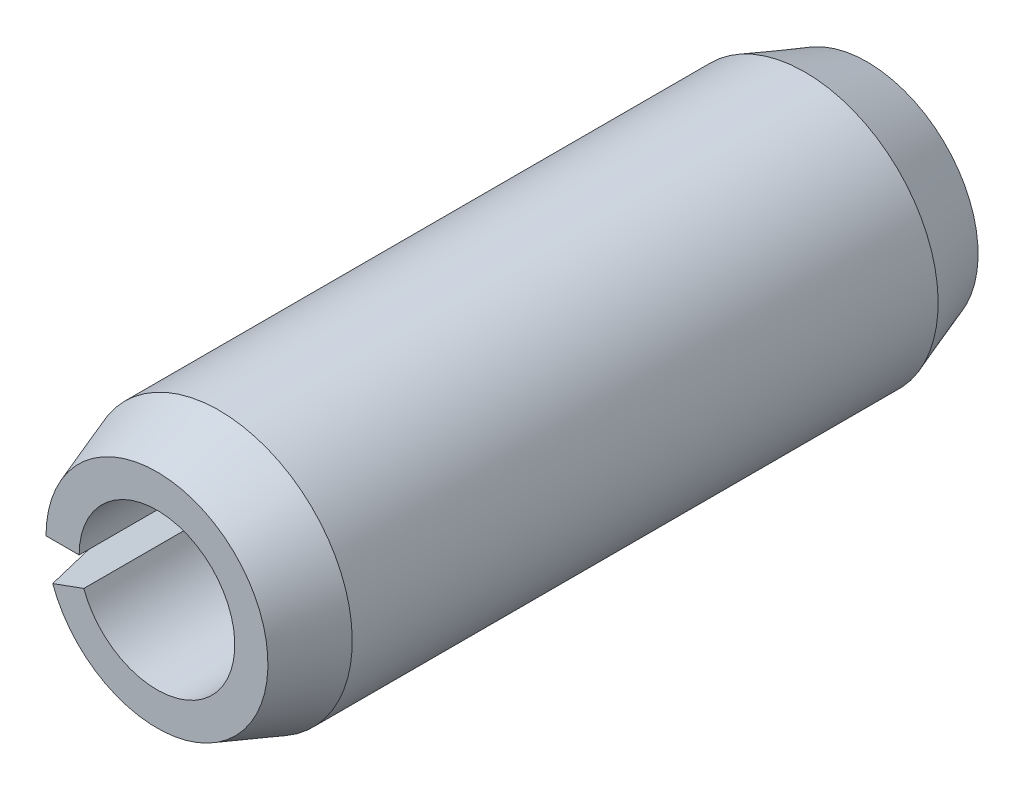
ISO-10303-21;
HEADER;
FILE_DESCRIPTION(('STEP AP214'),'2;1');
FILE_NAME('part.step','',(''),(''),'','','');
FILE_SCHEMA(('AUTOMOTIVE_DESIGN { 1 0 10303 214 1 1 1 1 }'));
ENDSEC;
DATA;
#1=APPLICATION_CONTEXT('core data for automotive mechanical design processes');
#2=APPLICATION_PROTOCOL_DEFINITION('international standard','automotive_design',2000,#1);
#3=PRODUCT_CONTEXT('',#1,'mechanical');
#4=PRODUCT('Part','Part','',(#3));
#5=PRODUCT_RELATED_PRODUCT_CATEGORY('part','',(#4));
#6=PRODUCT_DEFINITION_FORMATION('','',#4);
#7=PRODUCT_DEFINITION_CONTEXT('part definition',#1,'design');
#8=PRODUCT_DEFINITION('design','',#6,#7);
#9=PRODUCT_DEFINITION_SHAPE('','',#8);
#10=(LENGTH_UNIT() NAMED_UNIT(*) SI_UNIT(.MILLI.,.METRE.));
#11=(NAMED_UNIT(*) PLANE_ANGLE_UNIT() SI_UNIT($,.RADIAN.));
#12=(NAMED_UNIT(*) SI_UNIT($,.STERADIAN.) SOLID_ANGLE_UNIT());
#13=UNCERTAINTY_MEASURE_WITH_UNIT(LENGTH_MEASURE(1.E-05),#10,'distance_accuracy_value','');
#14=(GEOMETRIC_REPRESENTATION_CONTEXT(3) GLOBAL_UNCERTAINTY_ASSIGNED_CONTEXT((#13)) GLOBAL_UNIT_ASSIGNED_CONTEXT((#10,
#11,#12)) REPRESENTATION_CONTEXT('',''));
#15=CARTESIAN_POINT('',(0.,0.,0.));
#16=DIRECTION('',(0.,0.,1.));
#17=DIRECTION('',(1.,0.,0.));
#18=AXIS2_PLACEMENT_3D('',#15,#16,#17);
#19=CARTESIAN_POINT('',(-1.25,0.,8.));
#20=DIRECTION('',(0.,0.,1.));
#21=DIRECTION('',(1.,0.,0.));
#22=AXIS2_PLACEMENT_3D('',#19,#20,#21);
#23=PLANE('',#22);
#24=DIRECTION('',(-0.93969262078591,-0.342020143325665,0.));
#25=VECTOR('',#24,1.);
#26=CARTESIAN_POINT('',(-0.823935238988265,-0.299887901954738,8.));
#27=LINE('',#26,#25);
#28=CARTESIAN_POINT('',(-0.823935238988265,-0.299887901954738,8.));
#29=VERTEX_POINT('',#28);
#30=CARTESIAN_POINT('',(-1.1746157759685,-0.427525179152031,8.0000000000191));
#31=VERTEX_POINT('',#30);
#32=EDGE_CURVE('E83',#29,#31,#27,.T.);
#33=ORIENTED_EDGE('',*,*,#32,.T.);
#34=CARTESIAN_POINT('',(0.,0.,8.0000000000382));
#35=DIRECTION('',(0.,0.,-1.));
#36=DIRECTION('',(-1.,0.,0.));
#37=AXIS2_PLACEMENT_3D('',#34,#35,#36);
#38=CIRCLE('',#37,1.24999999997044);
#39=CARTESIAN_POINT('',(-1.24999999997631,0.,8.00000000002865));
#40=VERTEX_POINT('',#39);
#41=EDGE_CURVE('E71',#40,#31,#38,.T.);
#42=ORIENTED_EDGE('',*,*,#41,.F.);
#43=DIRECTION('',(1.,0.,0.));
#44=VECTOR('',#43,1.);
#45=CARTESIAN_POINT('',(-1.17342807180984,0.,8.));
#46=LINE('',#45,#44);
#47=CARTESIAN_POINT('',(-0.876813567290941,0.,8.));
#48=VERTEX_POINT('',#47);
#49=EDGE_CURVE('E67',#40,#48,#46,.T.);
#50=ORIENTED_EDGE('',*,*,#49,.T.);
#51=CARTESIAN_POINT('',(0.,0.,8.));
#52=DIRECTION('',(0.,0.,-1.));
#53=DIRECTION('',(-1.,0.,0.));
#54=AXIS2_PLACEMENT_3D('',#51,#52,#53);
#55=CIRCLE('',#54,0.876813567290941);
#56=EDGE_CURVE('E20',#48,#29,#55,.T.);
#57=ORIENTED_EDGE('',*,*,#56,.T.);
#58=EDGE_LOOP('',(#33,#42,#50,#57));
#59=FACE_BOUND('',#58,.T.);
#60=ADVANCED_FACE('F17',(#59),#23,.T.);
#61=CARTESIAN_POINT('',(0.,0.,4.));
#62=DIRECTION('',(0.,0.,-1.));
#63=DIRECTION('',(-1.,0.,0.));
#64=AXIS2_PLACEMENT_3D('',#61,#62,#63);
#65=CYLINDRICAL_SURFACE('',#64,0.876813567290941);
#66=CARTESIAN_POINT('',(0.,0.,0.));
#67=DIRECTION('',(0.,0.,-1.));
#68=DIRECTION('',(-1.,0.,0.));
#69=AXIS2_PLACEMENT_3D('',#66,#67,#68);
#70=CIRCLE('',#69,0.876813567290941);
#71=CARTESIAN_POINT('',(-0.823935238988266,-0.299887901954738,0.));
#72=VERTEX_POINT('',#71);
#73=CARTESIAN_POINT('',(-0.876813567290941,0.,0.));
#74=VERTEX_POINT('',#73);
#75=EDGE_CURVE('E76',#72,#74,#70,.F.);
#76=ORIENTED_EDGE('',*,*,#75,.F.);
#77=DIRECTION('',(0.,0.,1.));
#78=VECTOR('',#77,1.);
#79=CARTESIAN_POINT('',(-0.823935238988265,-0.299887901954737,4.));
#80=LINE('',#79,#78);
#81=EDGE_CURVE('E82',#29,#72,#80,.F.);
#82=ORIENTED_EDGE('',*,*,#81,.F.);
#83=ORIENTED_EDGE('',*,*,#56,.F.);
#84=DIRECTION('',(0.,0.,1.));
#85=VECTOR('',#84,1.);
#86=CARTESIAN_POINT('',(-0.876813567290941,0.,4.));
#87=LINE('',#86,#85);
#88=EDGE_CURVE('E75',#48,#74,#87,.F.);
#89=ORIENTED_EDGE('',*,*,#88,.T.);
#90=EDGE_LOOP('',(#76,#82,#83,#89));
#91=FACE_BOUND('',#90,.T.);
#92=ADVANCED_FACE('F79',(#91),#65,.F.);
#93=CARTESIAN_POINT('',(-0.876813567290942,0.,0.));
#94=DIRECTION('',(0.,0.,-1.));
#95=DIRECTION('',(-1.,0.,0.));
#96=AXIS2_PLACEMENT_3D('',#93,#94,#95);
#97=PLANE('',#96);
#98=DIRECTION('',(-0.939692620785908,-0.342020143325669,0.));
#99=VECTOR('',#98,1.);
#100=CARTESIAN_POINT('',(-1.10266170010275,-0.401336037302766,0.));
#101=LINE('',#100,#99);
#102=CARTESIAN_POINT('',(-1.17461577598999,-0.42752517916067,4.2632564145606E-11));
#103=VERTEX_POINT('',#102);
#104=EDGE_CURVE('E104',#72,#103,#101,.T.);
#105=ORIENTED_EDGE('',*,*,#104,.F.);
#106=ORIENTED_EDGE('',*,*,#75,.T.);
#107=DIRECTION('',(1.,0.,0.));
#108=VECTOR('',#107,1.);
#109=CARTESIAN_POINT('',(-1.17342807180984,0.,0.));
#110=LINE('',#109,#108);
#111=CARTESIAN_POINT('',(-1.24999999999763,0.,4.2632564145606E-11));
#112=VERTEX_POINT('',#111);
#113=EDGE_CURVE('E87',#74,#112,#110,.F.);
#114=ORIENTED_EDGE('',*,*,#113,.T.);
#115=CARTESIAN_POINT('',(0.,0.,5.6843418860808E-11));
#116=DIRECTION('',(0.,0.,1.));
#117=DIRECTION('',(1.,0.,0.));
#118=AXIS2_PLACEMENT_3D('',#115,#116,#117);
#119=CIRCLE('',#118,1.24999999999886);
#120=EDGE_CURVE('E95',#103,#112,#119,.T.);
#121=ORIENTED_EDGE('',*,*,#120,.F.);
#122=EDGE_LOOP('',(#105,#106,#114,#121));
#123=FACE_BOUND('',#122,.T.);
#124=ADVANCED_FACE('F102',(#123),#97,.T.);
#125=CARTESIAN_POINT('',(-1.17342807180984,0.,4.));
#126=DIRECTION('',(0.,1.,0.));
#127=DIRECTION('',(0.,0.,1.));
#128=AXIS2_PLACEMENT_3D('',#125,#126,#127);
#129=PLANE('',#128);
#130=DIRECTION('',(0.,0.,-1.));
#131=VECTOR('',#130,1.);
#132=CARTESIAN_POINT('',(-1.5,0.,4.));
#133=LINE('',#132,#131);
#134=CARTESIAN_POINT('',(-1.49999999998226,0.,0.699999999997408));
#135=VERTEX_POINT('',#134);
#136=CARTESIAN_POINT('',(-1.49999999999648,0.,7.29999999999159));
#137=VERTEX_POINT('',#136);
#138=EDGE_CURVE('E98',#135,#137,#133,.F.);
#139=ORIENTED_EDGE('',*,*,#138,.F.);
#140=DIRECTION('',(0.336336396999206,0.,-0.941741911594463));
#141=VECTOR('',#140,1.);
#142=CARTESIAN_POINT('',(-178215.535714913,0.,499000.));
#143=LINE('',#142,#141);
#144=EDGE_CURVE('E105',#112,#135,#143,.F.);
#145=ORIENTED_EDGE('',*,*,#144,.F.);
#146=ORIENTED_EDGE('',*,*,#113,.F.);
#147=ORIENTED_EDGE('',*,*,#88,.F.);
#148=ORIENTED_EDGE('',*,*,#49,.F.);
#149=DIRECTION('',(0.336336396999206,0.,0.941741911594463));
#150=VECTOR('',#149,1.);
#151=CARTESIAN_POINT('',(-178218.39285777,0.,-499000.));
#152=LINE('',#151,#150);
#153=EDGE_CURVE('E89',#137,#40,#152,.T.);
#154=ORIENTED_EDGE('',*,*,#153,.F.);
#155=EDGE_LOOP('',(#139,#145,#146,#147,#148,#154));
#156=FACE_BOUND('',#155,.T.);
#157=ADVANCED_FACE('F85',(#156),#129,.F.);
#158=CARTESIAN_POINT('',(0.,0.,7.29999999998654));
#159=DIRECTION('',(0.,0.,-1.));
#160=DIRECTION('',(-1.,0.,0.));
#161=AXIS2_PLACEMENT_3D('',#158,#159,#160);
#162=CONICAL_SURFACE('',#161,1.49999999999295,0.343023940425848);
#163=DIRECTION('',(0.31605283036088,0.115033822706946,0.94174191159484));
#164=VECTOR('',#163,1.);
#165=CARTESIAN_POINT('',(-1.40953893117886,-0.513030214988502,7.3));
#166=LINE('',#165,#164);
#167=CARTESIAN_POINT('',(-1.40953893117472,-0.513030214985391,7.29999999999327));
#168=VERTEX_POINT('',#167);
#169=EDGE_CURVE('E99',#168,#31,#166,.T.);
#170=ORIENTED_EDGE('',*,*,#169,.F.);
#171=CARTESIAN_POINT('',(0.,0.,7.3));
#172=DIRECTION('',(0.,0.,-1.));
#173=DIRECTION('',(-1.,0.,0.));
#174=AXIS2_PLACEMENT_3D('',#171,#172,#173);
#175=CIRCLE('',#174,1.5);
#176=EDGE_CURVE('E119',#137,#168,#175,.T.);
#177=ORIENTED_EDGE('',*,*,#176,.F.);
#178=ORIENTED_EDGE('',*,*,#153,.T.);
#179=ORIENTED_EDGE('',*,*,#41,.T.);
#180=EDGE_LOOP('',(#170,#177,#178,#179));
#181=FACE_BOUND('',#180,.T.);
#182=ADVANCED_FACE('F141',(#181),#162,.T.);
#183=CARTESIAN_POINT('',(-1.10266170010275,-0.401336037302766,4.));
#184=DIRECTION('',(-0.342020143325669,0.939692620785908,0.));
#185=DIRECTION('',(-0.939692620785908,-0.342020143325669,0.));
#186=AXIS2_PLACEMENT_3D('',#183,#184,#185);
#187=PLANE('',#186);
#188=DIRECTION('',(0.316052830361873,0.115033822707308,-0.941741911594463));
#189=VECTOR('',#188,1.);
#190=CARTESIAN_POINT('',(-167467.823820711,-60953.3030680754,499000.));
#191=LINE('',#190,#189);
#192=CARTESIAN_POINT('',(-1.40953893117057,-0.51303021498228,0.699999999994816));
#193=VERTEX_POINT('',#192);
#194=EDGE_CURVE('E35',#193,#103,#191,.T.);
#195=ORIENTED_EDGE('',*,*,#194,.F.);
#196=DIRECTION('',(0.,0.,-1.));
#197=VECTOR('',#196,1.);
#198=CARTESIAN_POINT('',(-1.40953893117886,-0.513030214988504,4.));
#199=LINE('',#198,#197);
#200=EDGE_CURVE('E26',#168,#193,#199,.T.);
#201=ORIENTED_EDGE('',*,*,#200,.F.);
#202=ORIENTED_EDGE('',*,*,#169,.T.);
#203=ORIENTED_EDGE('',*,*,#32,.F.);
#204=ORIENTED_EDGE('',*,*,#81,.T.);
#205=ORIENTED_EDGE('',*,*,#104,.T.);
#206=EDGE_LOOP('',(#195,#201,#202,#203,#204,#205));
#207=FACE_BOUND('',#206,.T.);
#208=ADVANCED_FACE('F108',(#207),#187,.T.);
#209=CARTESIAN_POINT('',(0.,0.,0.699999999994816));
#210=DIRECTION('',(0.,0.,1.));
#211=DIRECTION('',(1.,0.,0.));
#212=AXIS2_PLACEMENT_3D('',#209,#210,#211);
#213=CONICAL_SURFACE('',#212,1.49999999996453,0.343023940405271);
#214=ORIENTED_EDGE('',*,*,#194,.T.);
#215=ORIENTED_EDGE('',*,*,#120,.T.);
#216=ORIENTED_EDGE('',*,*,#144,.T.);
#217=CARTESIAN_POINT('',(0.,0.,0.7));
#218=DIRECTION('',(0.,0.,-1.));
#219=DIRECTION('',(-1.,0.,0.));
#220=AXIS2_PLACEMENT_3D('',#217,#218,#219);
#221=CIRCLE('',#220,1.5);
#222=EDGE_CURVE('E11',#193,#135,#221,.F.);
#223=ORIENTED_EDGE('',*,*,#222,.F.);
#224=EDGE_LOOP('',(#214,#215,#216,#223));
#225=FACE_BOUND('',#224,.T.);
#226=ADVANCED_FACE('F138',(#225),#213,.T.);
#227=CARTESIAN_POINT('',(0.,0.,4.));
#228=DIRECTION('',(0.,0.,-1.));
#229=DIRECTION('',(-1.,0.,0.));
#230=AXIS2_PLACEMENT_3D('',#227,#228,#229);
#231=CYLINDRICAL_SURFACE('',#230,1.5);
#232=ORIENTED_EDGE('',*,*,#200,.T.);
#233=ORIENTED_EDGE('',*,*,#222,.T.);
#234=ORIENTED_EDGE('',*,*,#138,.T.);
#235=ORIENTED_EDGE('',*,*,#176,.T.);
#236=EDGE_LOOP('',(#232,#233,#234,#235));
#237=FACE_BOUND('',#236,.T.);
#238=ADVANCED_FACE('F139',(#237),#231,.T.);
#239=CLOSED_SHELL('',(#60,#92,#124,#157,#182,#208,#226,#238));
#240=MANIFOLD_SOLID_BREP('B1',#239);
#241=ADVANCED_BREP_SHAPE_REPRESENTATION('',(#18,#240),#14);
#242=SHAPE_DEFINITION_REPRESENTATION(#9,#241);
ENDSEC;
END-ISO-10303-21;
